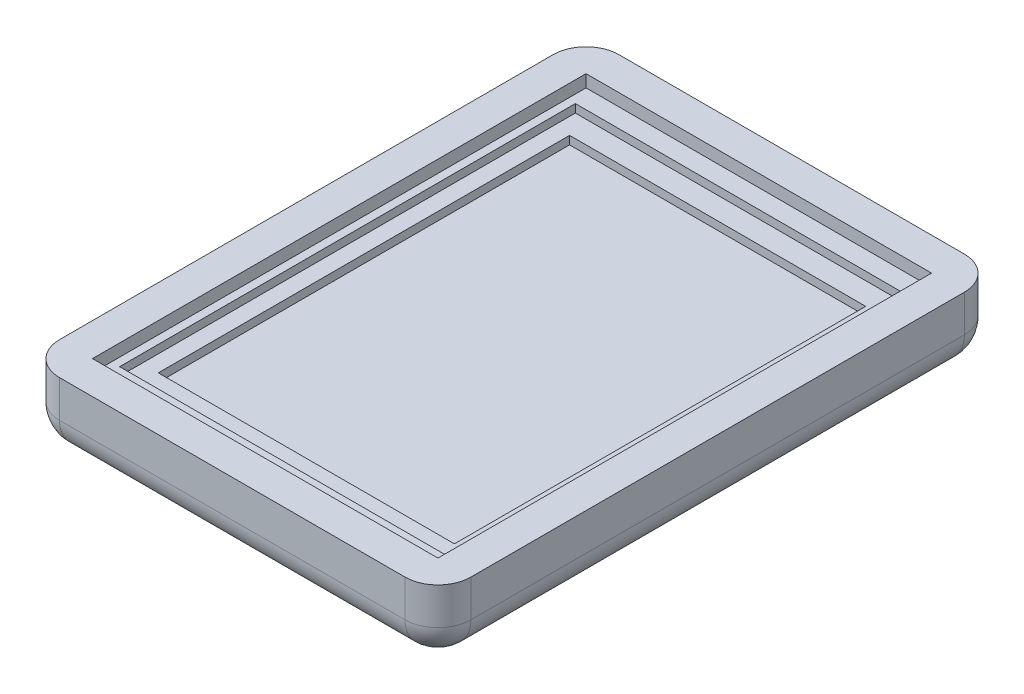
ISO-10303-21;
HEADER;
FILE_DESCRIPTION(('STEP AP214'),'2;1');
FILE_NAME('part.step','',(''),(''),'','','');
FILE_SCHEMA(('AUTOMOTIVE_DESIGN { 1 0 10303 214 1 1 1 1 }'));
ENDSEC;
DATA;
#1=APPLICATION_CONTEXT('core data for automotive mechanical design processes');
#2=APPLICATION_PROTOCOL_DEFINITION('international standard','automotive_design',2000,#1);
#3=PRODUCT_CONTEXT('',#1,'mechanical');
#4=PRODUCT('Part','Part','',(#3));
#5=PRODUCT_RELATED_PRODUCT_CATEGORY('part','',(#4));
#6=PRODUCT_DEFINITION_FORMATION('','',#4);
#7=PRODUCT_DEFINITION_CONTEXT('part definition',#1,'design');
#8=PRODUCT_DEFINITION('design','',#6,#7);
#9=PRODUCT_DEFINITION_SHAPE('','',#8);
#10=(LENGTH_UNIT() NAMED_UNIT(*) SI_UNIT(.MILLI.,.METRE.));
#11=(NAMED_UNIT(*) PLANE_ANGLE_UNIT() SI_UNIT($,.RADIAN.));
#12=(NAMED_UNIT(*) SI_UNIT($,.STERADIAN.) SOLID_ANGLE_UNIT());
#13=UNCERTAINTY_MEASURE_WITH_UNIT(LENGTH_MEASURE(1.E-05),#10,'distance_accuracy_value','');
#14=(GEOMETRIC_REPRESENTATION_CONTEXT(3) GLOBAL_UNCERTAINTY_ASSIGNED_CONTEXT((#13)) GLOBAL_UNIT_ASSIGNED_CONTEXT((#10,
#11,#12)) REPRESENTATION_CONTEXT('',''));
#15=CARTESIAN_POINT('',(0.,0.,0.));
#16=DIRECTION('',(0.,0.,1.));
#17=DIRECTION('',(1.,0.,0.));
#18=AXIS2_PLACEMENT_3D('',#15,#16,#17);
#19=CARTESIAN_POINT('',(0.,-1.905,0.));
#20=DIRECTION('',(0.,-1.,0.));
#21=DIRECTION('',(0.,0.,-1.));
#22=AXIS2_PLACEMENT_3D('',#19,#20,#21);
#23=PLANE('',#22);
#24=DIRECTION('',(0.,0.,-1.));
#25=VECTOR('',#24,1.);
#26=CARTESIAN_POINT('',(53.34,-1.905,-76.2));
#27=LINE('',#26,#25);
#28=CARTESIAN_POINT('',(53.34,-1.905,0.));
#29=VERTEX_POINT('',#28);
#30=CARTESIAN_POINT('',(53.34,-1.905,-76.2));
#31=VERTEX_POINT('',#30);
#32=EDGE_CURVE('E277',#29,#31,#27,.T.);
#33=ORIENTED_EDGE('',*,*,#32,.T.);
#34=DIRECTION('',(-1.,0.,0.));
#35=VECTOR('',#34,1.);
#36=CARTESIAN_POINT('',(53.34,-1.905,-76.2));
#37=LINE('',#36,#35);
#38=CARTESIAN_POINT('',(0.,-1.905,-76.2));
#39=VERTEX_POINT('',#38);
#40=EDGE_CURVE('E84',#31,#39,#37,.T.);
#41=ORIENTED_EDGE('',*,*,#40,.T.);
#42=DIRECTION('',(0.,0.,1.));
#43=VECTOR('',#42,1.);
#44=CARTESIAN_POINT('',(0.,-1.905,-76.2));
#45=LINE('',#44,#43);
#46=CARTESIAN_POINT('',(0.,-1.905,0.));
#47=VERTEX_POINT('',#46);
#48=EDGE_CURVE('E285',#39,#47,#45,.T.);
#49=ORIENTED_EDGE('',*,*,#48,.T.);
#50=DIRECTION('',(1.,0.,0.));
#51=VECTOR('',#50,1.);
#52=CARTESIAN_POINT('',(53.34,-1.905,0.));
#53=LINE('',#52,#51);
#54=EDGE_CURVE('E287',#47,#29,#53,.T.);
#55=ORIENTED_EDGE('',*,*,#54,.T.);
#56=EDGE_LOOP('',(#33,#41,#49,#55));
#57=FACE_BOUND('',#56,.T.);
#58=DIRECTION('',(0.,0.,-1.));
#59=VECTOR('',#58,1.);
#60=CARTESIAN_POINT('',(1.27,-1.905,0.));
#61=LINE('',#60,#59);
#62=CARTESIAN_POINT('',(1.27,-1.905,-2.92099999999999));
#63=VERTEX_POINT('',#62);
#64=CARTESIAN_POINT('',(1.27,-1.905,-73.279));
#65=VERTEX_POINT('',#64);
#66=EDGE_CURVE('E76',#63,#65,#61,.T.);
#67=ORIENTED_EDGE('',*,*,#66,.T.);
#68=DIRECTION('',(1.,0.,0.));
#69=VECTOR('',#68,1.);
#70=CARTESIAN_POINT('',(0.,-1.905,-73.279));
#71=LINE('',#70,#69);
#72=CARTESIAN_POINT('',(52.07,-1.905,-73.279));
#73=VERTEX_POINT('',#72);
#74=EDGE_CURVE('E249',#65,#73,#71,.T.);
#75=ORIENTED_EDGE('',*,*,#74,.T.);
#76=DIRECTION('',(0.,0.,-1.));
#77=VECTOR('',#76,1.);
#78=CARTESIAN_POINT('',(52.07,-1.905,0.));
#79=LINE('',#78,#77);
#80=CARTESIAN_POINT('',(52.07,-1.905,-2.92099999999999));
#81=VERTEX_POINT('',#80);
#82=EDGE_CURVE('E270',#81,#73,#79,.T.);
#83=ORIENTED_EDGE('',*,*,#82,.F.);
#84=DIRECTION('',(1.,0.,0.));
#85=VECTOR('',#84,1.);
#86=CARTESIAN_POINT('',(0.,-1.905,-2.92099999999999));
#87=LINE('',#86,#85);
#88=EDGE_CURVE('E267',#63,#81,#87,.T.);
#89=ORIENTED_EDGE('',*,*,#88,.F.);
#90=EDGE_LOOP('',(#67,#75,#83,#89));
#91=FACE_BOUND('',#90,.T.);
#92=ADVANCED_FACE('F59',(#57,#91),#23,.F.);
#93=CARTESIAN_POINT('',(0.,-5.715,0.));
#94=DIRECTION('',(0.,0.,1.));
#95=DIRECTION('',(1.,0.,0.));
#96=AXIS2_PLACEMENT_3D('',#93,#94,#95);
#97=PLANE('',#96);
#98=ORIENTED_EDGE('',*,*,#54,.F.);
#99=DIRECTION('',(0.,1.,0.));
#100=VECTOR('',#99,1.);
#101=CARTESIAN_POINT('',(0.,-5.715,0.));
#102=LINE('',#101,#100);
#103=CARTESIAN_POINT('',(0.,0.,0.));
#104=VERTEX_POINT('',#103);
#105=EDGE_CURVE('E314',#47,#104,#102,.T.);
#106=ORIENTED_EDGE('',*,*,#105,.T.);
#107=DIRECTION('',(1.,0.,0.));
#108=VECTOR('',#107,1.);
#109=CARTESIAN_POINT('',(0.,0.,0.));
#110=LINE('',#109,#108);
#111=CARTESIAN_POINT('',(53.34,0.,0.));
#112=VERTEX_POINT('',#111);
#113=EDGE_CURVE('E302',#104,#112,#110,.T.);
#114=ORIENTED_EDGE('',*,*,#113,.T.);
#115=DIRECTION('',(0.,1.,0.));
#116=VECTOR('',#115,1.);
#117=CARTESIAN_POINT('',(53.34,-5.715,0.));
#118=LINE('',#117,#116);
#119=EDGE_CURVE('E315',#29,#112,#118,.T.);
#120=ORIENTED_EDGE('',*,*,#119,.F.);
#121=EDGE_LOOP('',(#98,#106,#114,#120));
#122=FACE_BOUND('',#121,.T.);
#123=ADVANCED_FACE('F465',(#122),#97,.F.);
#124=CARTESIAN_POINT('',(53.34,-5.715,0.));
#125=DIRECTION('',(1.,0.,0.));
#126=DIRECTION('',(0.,0.,-1.));
#127=AXIS2_PLACEMENT_3D('',#124,#125,#126);
#128=PLANE('',#127);
#129=ORIENTED_EDGE('',*,*,#32,.F.);
#130=ORIENTED_EDGE('',*,*,#119,.T.);
#131=DIRECTION('',(0.,0.,-1.));
#132=VECTOR('',#131,1.);
#133=CARTESIAN_POINT('',(53.34,0.,0.));
#134=LINE('',#133,#132);
#135=CARTESIAN_POINT('',(53.34,0.,-76.2));
#136=VERTEX_POINT('',#135);
#137=EDGE_CURVE('E311',#112,#136,#134,.T.);
#138=ORIENTED_EDGE('',*,*,#137,.T.);
#139=DIRECTION('',(0.,1.,0.));
#140=VECTOR('',#139,1.);
#141=CARTESIAN_POINT('',(53.34,-5.715,-76.2));
#142=LINE('',#141,#140);
#143=EDGE_CURVE('E318',#31,#136,#142,.T.);
#144=ORIENTED_EDGE('',*,*,#143,.F.);
#145=EDGE_LOOP('',(#129,#130,#138,#144));
#146=FACE_BOUND('',#145,.T.);
#147=ADVANCED_FACE('F470',(#146),#128,.F.);
#148=CARTESIAN_POINT('',(0.,-5.715,-76.2));
#149=DIRECTION('',(0.,0.,1.));
#150=DIRECTION('',(1.,0.,0.));
#151=AXIS2_PLACEMENT_3D('',#148,#149,#150);
#152=PLANE('',#151);
#153=DIRECTION('',(0.,1.,0.));
#154=VECTOR('',#153,1.);
#155=CARTESIAN_POINT('',(0.,-5.715,-76.2));
#156=LINE('',#155,#154);
#157=CARTESIAN_POINT('',(0.,0.,-76.2));
#158=VERTEX_POINT('',#157);
#159=EDGE_CURVE('E320',#39,#158,#156,.T.);
#160=ORIENTED_EDGE('',*,*,#159,.F.);
#161=ORIENTED_EDGE('',*,*,#40,.F.);
#162=ORIENTED_EDGE('',*,*,#143,.T.);
#163=DIRECTION('',(1.,0.,0.));
#164=VECTOR('',#163,1.);
#165=CARTESIAN_POINT('',(0.,0.,-76.2));
#166=LINE('',#165,#164);
#167=EDGE_CURVE('E308',#158,#136,#166,.T.);
#168=ORIENTED_EDGE('',*,*,#167,.F.);
#169=EDGE_LOOP('',(#160,#161,#162,#168));
#170=FACE_BOUND('',#169,.T.);
#171=ADVANCED_FACE('F482',(#170),#152,.T.);
#172=CARTESIAN_POINT('',(0.,-5.715,0.));
#173=DIRECTION('',(1.,0.,0.));
#174=DIRECTION('',(0.,0.,-1.));
#175=AXIS2_PLACEMENT_3D('',#172,#173,#174);
#176=PLANE('',#175);
#177=ORIENTED_EDGE('',*,*,#105,.F.);
#178=ORIENTED_EDGE('',*,*,#48,.F.);
#179=ORIENTED_EDGE('',*,*,#159,.T.);
#180=DIRECTION('',(0.,0.,-1.));
#181=VECTOR('',#180,1.);
#182=CARTESIAN_POINT('',(0.,0.,0.));
#183=LINE('',#182,#181);
#184=EDGE_CURVE('E305',#104,#158,#183,.T.);
#185=ORIENTED_EDGE('',*,*,#184,.F.);
#186=EDGE_LOOP('',(#177,#178,#179,#185));
#187=FACE_BOUND('',#186,.T.);
#188=ADVANCED_FACE('F486',(#187),#176,.T.);
#189=CARTESIAN_POINT('',(0.,-5.715,5.08));
#190=DIRECTION('',(0.,0.,-1.));
#191=DIRECTION('',(-1.,0.,0.));
#192=AXIS2_PLACEMENT_3D('',#189,#190,#191);
#193=PLANE('',#192);
#194=DIRECTION('',(-1.,0.,0.));
#195=VECTOR('',#194,1.);
#196=CARTESIAN_POINT('',(0.,0.,5.08));
#197=LINE('',#196,#195);
#198=CARTESIAN_POINT('',(53.34,0.,5.07999999999999));
#199=VERTEX_POINT('',#198);
#200=CARTESIAN_POINT('',(0.,0.,5.08));
#201=VERTEX_POINT('',#200);
#202=EDGE_CURVE('E290',#199,#201,#197,.T.);
#203=ORIENTED_EDGE('',*,*,#202,.T.);
#204=DIRECTION('',(0.,1.,0.));
#205=VECTOR('',#204,1.);
#206=CARTESIAN_POINT('',(0.,-5.715,5.08));
#207=LINE('',#206,#205);
#208=CARTESIAN_POINT('',(0.,-5.715,5.08));
#209=VERTEX_POINT('',#208);
#210=EDGE_CURVE('E350',#201,#209,#207,.F.);
#211=ORIENTED_EDGE('',*,*,#210,.T.);
#212=DIRECTION('',(-1.,0.,0.));
#213=VECTOR('',#212,1.);
#214=CARTESIAN_POINT('',(0.,-5.715,5.08));
#215=LINE('',#214,#213);
#216=CARTESIAN_POINT('',(53.34,-5.715,5.07999999999999));
#217=VERTEX_POINT('',#216);
#218=EDGE_CURVE('E348',#209,#217,#215,.F.);
#219=ORIENTED_EDGE('',*,*,#218,.T.);
#220=DIRECTION('',(0.,1.,0.));
#221=VECTOR('',#220,1.);
#222=CARTESIAN_POINT('',(53.34,0.,5.07999999999999));
#223=LINE('',#222,#221);
#224=EDGE_CURVE('E346',#217,#199,#223,.T.);
#225=ORIENTED_EDGE('',*,*,#224,.T.);
#226=EDGE_LOOP('',(#203,#211,#219,#225));
#227=FACE_BOUND('',#226,.T.);
#228=ADVANCED_FACE('F456',(#227),#193,.F.);
#229=CARTESIAN_POINT('',(-5.08,-5.715,0.));
#230=DIRECTION('',(1.,0.,0.));
#231=DIRECTION('',(0.,0.,-1.));
#232=AXIS2_PLACEMENT_3D('',#229,#230,#231);
#233=PLANE('',#232);
#234=DIRECTION('',(0.,0.,-1.));
#235=VECTOR('',#234,1.);
#236=CARTESIAN_POINT('',(-5.08,-5.715,0.));
#237=LINE('',#236,#235);
#238=CARTESIAN_POINT('',(-5.08,-5.715,-76.2));
#239=VERTEX_POINT('',#238);
#240=CARTESIAN_POINT('',(-5.08,-5.715,0.));
#241=VERTEX_POINT('',#240);
#242=EDGE_CURVE('E333',#239,#241,#237,.F.);
#243=ORIENTED_EDGE('',*,*,#242,.T.);
#244=DIRECTION('',(0.,1.,0.));
#245=VECTOR('',#244,1.);
#246=CARTESIAN_POINT('',(-5.08,-5.715,0.));
#247=LINE('',#246,#245);
#248=CARTESIAN_POINT('',(-5.08,0.,0.));
#249=VERTEX_POINT('',#248);
#250=EDGE_CURVE('E336',#241,#249,#247,.T.);
#251=ORIENTED_EDGE('',*,*,#250,.T.);
#252=DIRECTION('',(0.,0.,-1.));
#253=VECTOR('',#252,1.);
#254=CARTESIAN_POINT('',(-5.08,0.,0.));
#255=LINE('',#254,#253);
#256=CARTESIAN_POINT('',(-5.08,0.,-76.2));
#257=VERTEX_POINT('',#256);
#258=EDGE_CURVE('E299',#249,#257,#255,.T.);
#259=ORIENTED_EDGE('',*,*,#258,.T.);
#260=DIRECTION('',(0.,1.,0.));
#261=VECTOR('',#260,1.);
#262=CARTESIAN_POINT('',(-5.08,-5.715,-76.2));
#263=LINE('',#262,#261);
#264=EDGE_CURVE('E331',#257,#239,#263,.F.);
#265=ORIENTED_EDGE('',*,*,#264,.T.);
#266=EDGE_LOOP('',(#243,#251,#259,#265));
#267=FACE_BOUND('',#266,.T.);
#268=ADVANCED_FACE('F448',(#267),#233,.F.);
#269=CARTESIAN_POINT('',(0.,-5.715,-81.28));
#270=DIRECTION('',(0.,0.,1.));
#271=DIRECTION('',(1.,0.,0.));
#272=AXIS2_PLACEMENT_3D('',#269,#270,#271);
#273=PLANE('',#272);
#274=DIRECTION('',(1.,0.,0.));
#275=VECTOR('',#274,1.);
#276=CARTESIAN_POINT('',(0.,0.,-81.28));
#277=LINE('',#276,#275);
#278=CARTESIAN_POINT('',(0.,0.,-81.28));
#279=VERTEX_POINT('',#278);
#280=CARTESIAN_POINT('',(53.34,0.,-81.28));
#281=VERTEX_POINT('',#280);
#282=EDGE_CURVE('E296',#279,#281,#277,.T.);
#283=ORIENTED_EDGE('',*,*,#282,.T.);
#284=DIRECTION('',(0.,1.,0.));
#285=VECTOR('',#284,1.);
#286=CARTESIAN_POINT('',(53.34,-10.795,-81.28));
#287=LINE('',#286,#285);
#288=CARTESIAN_POINT('',(53.34,-5.715,-81.28));
#289=VERTEX_POINT('',#288);
#290=EDGE_CURVE('E13',#281,#289,#287,.F.);
#291=ORIENTED_EDGE('',*,*,#290,.T.);
#292=DIRECTION('',(1.,0.,0.));
#293=VECTOR('',#292,1.);
#294=CARTESIAN_POINT('',(0.,-5.715,-81.28));
#295=LINE('',#294,#293);
#296=CARTESIAN_POINT('',(0.,-5.715,-81.28));
#297=VERTEX_POINT('',#296);
#298=EDGE_CURVE('E68',#289,#297,#295,.F.);
#299=ORIENTED_EDGE('',*,*,#298,.T.);
#300=DIRECTION('',(0.,1.,0.));
#301=VECTOR('',#300,1.);
#302=CARTESIAN_POINT('',(0.,-5.715,-81.28));
#303=LINE('',#302,#301);
#304=EDGE_CURVE('E358',#297,#279,#303,.T.);
#305=ORIENTED_EDGE('',*,*,#304,.T.);
#306=EDGE_LOOP('',(#283,#291,#299,#305));
#307=FACE_BOUND('',#306,.T.);
#308=ADVANCED_FACE('F431',(#307),#273,.F.);
#309=CARTESIAN_POINT('',(58.42,-5.715,0.));
#310=DIRECTION('',(1.,0.,0.));
#311=DIRECTION('',(0.,0.,-1.));
#312=AXIS2_PLACEMENT_3D('',#309,#310,#311);
#313=PLANE('',#312);
#314=DIRECTION('',(0.,0.,-1.));
#315=VECTOR('',#314,1.);
#316=CARTESIAN_POINT('',(58.42,0.,0.));
#317=LINE('',#316,#315);
#318=CARTESIAN_POINT('',(58.42,0.,0.));
#319=VERTEX_POINT('',#318);
#320=CARTESIAN_POINT('',(58.42,0.,-76.2));
#321=VERTEX_POINT('',#320);
#322=EDGE_CURVE('E293',#319,#321,#317,.T.);
#323=ORIENTED_EDGE('',*,*,#322,.F.);
#324=DIRECTION('',(0.,1.,0.));
#325=VECTOR('',#324,1.);
#326=CARTESIAN_POINT('',(58.42,-10.795,0.));
#327=LINE('',#326,#325);
#328=CARTESIAN_POINT('',(58.42,-5.715,0.));
#329=VERTEX_POINT('',#328);
#330=EDGE_CURVE('E356',#319,#329,#327,.F.);
#331=ORIENTED_EDGE('',*,*,#330,.T.);
#332=DIRECTION('',(0.,0.,1.));
#333=VECTOR('',#332,1.);
#334=CARTESIAN_POINT('',(58.42,-5.715,-81.28));
#335=LINE('',#334,#333);
#336=CARTESIAN_POINT('',(58.42,-5.715,-76.2));
#337=VERTEX_POINT('',#336);
#338=EDGE_CURVE('E354',#329,#337,#335,.F.);
#339=ORIENTED_EDGE('',*,*,#338,.T.);
#340=DIRECTION('',(0.,1.,0.));
#341=VECTOR('',#340,1.);
#342=CARTESIAN_POINT('',(58.42,0.,-76.2));
#343=LINE('',#342,#341);
#344=EDGE_CURVE('E352',#337,#321,#343,.T.);
#345=ORIENTED_EDGE('',*,*,#344,.T.);
#346=EDGE_LOOP('',(#323,#331,#339,#345));
#347=FACE_BOUND('',#346,.T.);
#348=ADVANCED_FACE('F417',(#347),#313,.T.);
#349=CARTESIAN_POINT('',(0.,0.,0.));
#350=DIRECTION('',(0.,1.,0.));
#351=DIRECTION('',(0.,0.,1.));
#352=AXIS2_PLACEMENT_3D('',#349,#350,#351);
#353=PLANE('',#352);
#354=ORIENTED_EDGE('',*,*,#258,.F.);
#355=CARTESIAN_POINT('',(0.,0.,0.));
#356=DIRECTION('',(0.,1.,0.));
#357=DIRECTION('',(0.,0.,1.));
#358=AXIS2_PLACEMENT_3D('',#355,#356,#357);
#359=CIRCLE('',#358,5.08);
#360=EDGE_CURVE('E344',#249,#201,#359,.T.);
#361=ORIENTED_EDGE('',*,*,#360,.T.);
#362=ORIENTED_EDGE('',*,*,#202,.F.);
#363=CARTESIAN_POINT('',(53.34,0.,0.));
#364=DIRECTION('',(0.,1.,0.));
#365=DIRECTION('',(0.,0.,1.));
#366=AXIS2_PLACEMENT_3D('',#363,#364,#365);
#367=CIRCLE('',#366,5.08);
#368=EDGE_CURVE('E342',#199,#319,#367,.T.);
#369=ORIENTED_EDGE('',*,*,#368,.T.);
#370=ORIENTED_EDGE('',*,*,#322,.T.);
#371=CARTESIAN_POINT('',(53.34,0.,-76.2));
#372=DIRECTION('',(0.,1.,0.));
#373=DIRECTION('',(0.,0.,1.));
#374=AXIS2_PLACEMENT_3D('',#371,#372,#373);
#375=CIRCLE('',#374,5.08);
#376=EDGE_CURVE('E340',#321,#281,#375,.T.);
#377=ORIENTED_EDGE('',*,*,#376,.T.);
#378=ORIENTED_EDGE('',*,*,#282,.F.);
#379=CARTESIAN_POINT('',(0.,0.,-76.2));
#380=DIRECTION('',(0.,1.,0.));
#381=DIRECTION('',(0.,0.,1.));
#382=AXIS2_PLACEMENT_3D('',#379,#380,#381);
#383=CIRCLE('',#382,5.08);
#384=EDGE_CURVE('E338',#279,#257,#383,.T.);
#385=ORIENTED_EDGE('',*,*,#384,.T.);
#386=EDGE_LOOP('',(#354,#361,#362,#369,#370,#377,#378,#385));
#387=FACE_BOUND('',#386,.T.);
#388=ORIENTED_EDGE('',*,*,#113,.F.);
#389=ORIENTED_EDGE('',*,*,#184,.T.);
#390=ORIENTED_EDGE('',*,*,#167,.T.);
#391=ORIENTED_EDGE('',*,*,#137,.F.);
#392=EDGE_LOOP('',(#388,#389,#390,#391));
#393=FACE_BOUND('',#392,.T.);
#394=ADVANCED_FACE('F427',(#387,#393),#353,.T.);
#395=CARTESIAN_POINT('',(0.,-10.795,0.));
#396=DIRECTION('',(0.,1.,0.));
#397=DIRECTION('',(0.,0.,1.));
#398=AXIS2_PLACEMENT_3D('',#395,#396,#397);
#399=PLANE('',#398);
#400=DIRECTION('',(-1.,0.,0.));
#401=VECTOR('',#400,1.);
#402=CARTESIAN_POINT('',(0.,-10.795,0.));
#403=LINE('',#402,#401);
#404=CARTESIAN_POINT('',(53.34,-10.795,0.));
#405=VERTEX_POINT('',#404);
#406=CARTESIAN_POINT('',(0.,-10.795,0.));
#407=VERTEX_POINT('',#406);
#408=EDGE_CURVE('E326',#405,#407,#403,.T.);
#409=ORIENTED_EDGE('',*,*,#408,.T.);
#410=DIRECTION('',(0.,0.,-1.));
#411=VECTOR('',#410,1.);
#412=CARTESIAN_POINT('',(0.,-10.795,0.));
#413=LINE('',#412,#411);
#414=CARTESIAN_POINT('',(0.,-10.795,-76.2));
#415=VERTEX_POINT('',#414);
#416=EDGE_CURVE('E328',#407,#415,#413,.T.);
#417=ORIENTED_EDGE('',*,*,#416,.T.);
#418=DIRECTION('',(1.,0.,0.));
#419=VECTOR('',#418,1.);
#420=CARTESIAN_POINT('',(0.,-10.795,-76.2));
#421=LINE('',#420,#419);
#422=CARTESIAN_POINT('',(53.34,-10.795,-76.2));
#423=VERTEX_POINT('',#422);
#424=EDGE_CURVE('E317',#415,#423,#421,.T.);
#425=ORIENTED_EDGE('',*,*,#424,.T.);
#426=DIRECTION('',(0.,0.,1.));
#427=VECTOR('',#426,1.);
#428=CARTESIAN_POINT('',(53.34,-10.795,5.08));
#429=LINE('',#428,#427);
#430=EDGE_CURVE('E324',#423,#405,#429,.T.);
#431=ORIENTED_EDGE('',*,*,#430,.T.);
#432=EDGE_LOOP('',(#409,#417,#425,#431));
#433=FACE_BOUND('',#432,.T.);
#434=ADVANCED_FACE('F406',(#433),#399,.F.);
#435=CARTESIAN_POINT('',(53.34,-5.715,0.));
#436=DIRECTION('',(0.,-1.,0.));
#437=DIRECTION('',(0.,0.,-1.));
#438=AXIS2_PLACEMENT_3D('',#435,#436,#437);
#439=CYLINDRICAL_SURFACE('',#438,5.08);
#440=ORIENTED_EDGE('',*,*,#368,.F.);
#441=ORIENTED_EDGE('',*,*,#224,.F.);
#442=CARTESIAN_POINT('',(53.34,-5.715,0.));
#443=DIRECTION('',(0.,-1.,0.));
#444=DIRECTION('',(0.,0.,-1.));
#445=AXIS2_PLACEMENT_3D('',#442,#443,#444);
#446=CIRCLE('',#445,5.08);
#447=EDGE_CURVE('E63',#329,#217,#446,.T.);
#448=ORIENTED_EDGE('',*,*,#447,.F.);
#449=ORIENTED_EDGE('',*,*,#330,.F.);
#450=EDGE_LOOP('',(#440,#441,#448,#449));
#451=FACE_BOUND('',#450,.T.);
#452=ADVANCED_FACE('F61',(#451),#439,.T.);
#453=CARTESIAN_POINT('',(53.34,-5.715,0.));
#454=DIRECTION('',(0.,0.,-1.));
#455=DIRECTION('',(-1.,0.,0.));
#456=AXIS2_PLACEMENT_3D('',#453,#454,#455);
#457=CYLINDRICAL_SURFACE('',#456,5.08);
#458=CARTESIAN_POINT('',(53.34,-5.715,-76.2));
#459=DIRECTION('',(0.,0.,-1.));
#460=DIRECTION('',(-1.,0.,0.));
#461=AXIS2_PLACEMENT_3D('',#458,#459,#460);
#462=CIRCLE('',#461,5.08);
#463=EDGE_CURVE('E385',#337,#423,#462,.T.);
#464=ORIENTED_EDGE('',*,*,#463,.F.);
#465=ORIENTED_EDGE('',*,*,#338,.F.);
#466=CARTESIAN_POINT('',(53.34,-5.715,0.));
#467=DIRECTION('',(0.,0.,1.));
#468=DIRECTION('',(1.,0.,0.));
#469=AXIS2_PLACEMENT_3D('',#466,#467,#468);
#470=CIRCLE('',#469,5.08);
#471=EDGE_CURVE('E387',#405,#329,#470,.T.);
#472=ORIENTED_EDGE('',*,*,#471,.F.);
#473=ORIENTED_EDGE('',*,*,#430,.F.);
#474=EDGE_LOOP('',(#464,#465,#472,#473));
#475=FACE_BOUND('',#474,.T.);
#476=ADVANCED_FACE('F413',(#475),#457,.T.);
#477=CARTESIAN_POINT('',(53.34,-5.715,-76.2));
#478=DIRECTION('',(0.,-1.,0.));
#479=DIRECTION('',(0.,0.,-1.));
#480=AXIS2_PLACEMENT_3D('',#477,#478,#479);
#481=CYLINDRICAL_SURFACE('',#480,5.08);
#482=ORIENTED_EDGE('',*,*,#376,.F.);
#483=ORIENTED_EDGE('',*,*,#344,.F.);
#484=CARTESIAN_POINT('',(53.34,-5.715,-76.2));
#485=DIRECTION('',(0.,-1.,0.));
#486=DIRECTION('',(0.,0.,-1.));
#487=AXIS2_PLACEMENT_3D('',#484,#485,#486);
#488=CIRCLE('',#487,5.08);
#489=EDGE_CURVE('E382',#289,#337,#488,.T.);
#490=ORIENTED_EDGE('',*,*,#489,.F.);
#491=ORIENTED_EDGE('',*,*,#290,.F.);
#492=EDGE_LOOP('',(#482,#483,#490,#491));
#493=FACE_BOUND('',#492,.T.);
#494=ADVANCED_FACE('F421',(#493),#481,.T.);
#495=CARTESIAN_POINT('',(53.34,-5.715,0.));
#496=DIRECTION('',(0.,0.,1.));
#497=DIRECTION('',(1.,0.,0.));
#498=AXIS2_PLACEMENT_3D('',#495,#496,#497);
#499=SPHERICAL_SURFACE('',#498,5.08);
#500=ORIENTED_EDGE('',*,*,#471,.T.);
#501=ORIENTED_EDGE('',*,*,#447,.T.);
#502=CARTESIAN_POINT('',(53.34,-5.715,0.));
#503=DIRECTION('',(1.,0.,0.));
#504=DIRECTION('',(0.,0.,-1.));
#505=AXIS2_PLACEMENT_3D('',#502,#503,#504);
#506=CIRCLE('',#505,5.08);
#507=EDGE_CURVE('E379',#405,#217,#506,.F.);
#508=ORIENTED_EDGE('',*,*,#507,.F.);
#509=EDGE_LOOP('',(#500,#501,#508));
#510=FACE_BOUND('',#509,.T.);
#511=ADVANCED_FACE('F394',(#510),#499,.T.);
#512=CARTESIAN_POINT('',(53.34,-5.715,-76.2));
#513=DIRECTION('',(0.,0.,1.));
#514=DIRECTION('',(1.,0.,0.));
#515=AXIS2_PLACEMENT_3D('',#512,#513,#514);
#516=SPHERICAL_SURFACE('',#515,5.08);
#517=ORIENTED_EDGE('',*,*,#489,.T.);
#518=ORIENTED_EDGE('',*,*,#463,.T.);
#519=CARTESIAN_POINT('',(53.34,-5.715,-76.2));
#520=DIRECTION('',(1.,0.,0.));
#521=DIRECTION('',(0.,0.,-1.));
#522=AXIS2_PLACEMENT_3D('',#519,#520,#521);
#523=CIRCLE('',#522,5.08);
#524=EDGE_CURVE('E376',#289,#423,#523,.F.);
#525=ORIENTED_EDGE('',*,*,#524,.F.);
#526=EDGE_LOOP('',(#517,#518,#525));
#527=FACE_BOUND('',#526,.T.);
#528=ADVANCED_FACE('F515',(#527),#516,.T.);
#529=CARTESIAN_POINT('',(0.,-5.715,0.));
#530=DIRECTION('',(0.,1.,0.));
#531=DIRECTION('',(0.,0.,1.));
#532=AXIS2_PLACEMENT_3D('',#529,#530,#531);
#533=CYLINDRICAL_SURFACE('',#532,5.08);
#534=ORIENTED_EDGE('',*,*,#360,.F.);
#535=ORIENTED_EDGE('',*,*,#250,.F.);
#536=CARTESIAN_POINT('',(0.,-5.715,0.));
#537=DIRECTION('',(0.,-1.,0.));
#538=DIRECTION('',(0.,0.,-1.));
#539=AXIS2_PLACEMENT_3D('',#536,#537,#538);
#540=CIRCLE('',#539,5.08);
#541=EDGE_CURVE('E373',#209,#241,#540,.T.);
#542=ORIENTED_EDGE('',*,*,#541,.F.);
#543=ORIENTED_EDGE('',*,*,#210,.F.);
#544=EDGE_LOOP('',(#534,#535,#542,#543));
#545=FACE_BOUND('',#544,.T.);
#546=ADVANCED_FACE('F454',(#545),#533,.T.);
#547=CARTESIAN_POINT('',(0.,-5.715,0.));
#548=DIRECTION('',(-1.,0.,0.));
#549=DIRECTION('',(0.,0.,1.));
#550=AXIS2_PLACEMENT_3D('',#547,#548,#549);
#551=CYLINDRICAL_SURFACE('',#550,5.08);
#552=ORIENTED_EDGE('',*,*,#507,.T.);
#553=ORIENTED_EDGE('',*,*,#218,.F.);
#554=CARTESIAN_POINT('',(0.,-5.715,0.));
#555=DIRECTION('',(-1.,0.,0.));
#556=DIRECTION('',(0.,0.,1.));
#557=AXIS2_PLACEMENT_3D('',#554,#555,#556);
#558=CIRCLE('',#557,5.08);
#559=EDGE_CURVE('E370',#407,#209,#558,.T.);
#560=ORIENTED_EDGE('',*,*,#559,.F.);
#561=ORIENTED_EDGE('',*,*,#408,.F.);
#562=EDGE_LOOP('',(#552,#553,#560,#561));
#563=FACE_BOUND('',#562,.T.);
#564=ADVANCED_FACE('F401',(#563),#551,.T.);
#565=CARTESIAN_POINT('',(0.,-5.715,-76.2));
#566=DIRECTION('',(1.,0.,0.));
#567=DIRECTION('',(0.,0.,-1.));
#568=AXIS2_PLACEMENT_3D('',#565,#566,#567);
#569=CYLINDRICAL_SURFACE('',#568,5.08);
#570=ORIENTED_EDGE('',*,*,#524,.T.);
#571=ORIENTED_EDGE('',*,*,#424,.F.);
#572=CARTESIAN_POINT('',(0.,-5.715,-76.2));
#573=DIRECTION('',(-1.,0.,0.));
#574=DIRECTION('',(0.,0.,1.));
#575=AXIS2_PLACEMENT_3D('',#572,#573,#574);
#576=CIRCLE('',#575,5.08);
#577=EDGE_CURVE('E367',#297,#415,#576,.T.);
#578=ORIENTED_EDGE('',*,*,#577,.F.);
#579=ORIENTED_EDGE('',*,*,#298,.F.);
#580=EDGE_LOOP('',(#570,#571,#578,#579));
#581=FACE_BOUND('',#580,.T.);
#582=ADVANCED_FACE('F441',(#581),#569,.T.);
#583=CARTESIAN_POINT('',(0.,-5.715,-76.2));
#584=DIRECTION('',(0.,1.,0.));
#585=DIRECTION('',(0.,0.,1.));
#586=AXIS2_PLACEMENT_3D('',#583,#584,#585);
#587=CYLINDRICAL_SURFACE('',#586,5.08);
#588=ORIENTED_EDGE('',*,*,#384,.F.);
#589=ORIENTED_EDGE('',*,*,#304,.F.);
#590=CARTESIAN_POINT('',(0.,-5.715,-76.2));
#591=DIRECTION('',(0.,-1.,0.));
#592=DIRECTION('',(0.,0.,-1.));
#593=AXIS2_PLACEMENT_3D('',#590,#591,#592);
#594=CIRCLE('',#593,5.08);
#595=EDGE_CURVE('E364',#239,#297,#594,.T.);
#596=ORIENTED_EDGE('',*,*,#595,.F.);
#597=ORIENTED_EDGE('',*,*,#264,.F.);
#598=EDGE_LOOP('',(#588,#589,#596,#597));
#599=FACE_BOUND('',#598,.T.);
#600=ADVANCED_FACE('F437',(#599),#587,.T.);
#601=CARTESIAN_POINT('',(0.,-5.715,0.));
#602=DIRECTION('',(0.,0.,1.));
#603=DIRECTION('',(1.,0.,0.));
#604=AXIS2_PLACEMENT_3D('',#601,#602,#603);
#605=SPHERICAL_SURFACE('',#604,5.08);
#606=ORIENTED_EDGE('',*,*,#559,.T.);
#607=ORIENTED_EDGE('',*,*,#541,.T.);
#608=CARTESIAN_POINT('',(0.,-5.715,0.));
#609=DIRECTION('',(0.,0.,1.));
#610=DIRECTION('',(1.,0.,0.));
#611=AXIS2_PLACEMENT_3D('',#608,#609,#610);
#612=CIRCLE('',#611,5.08);
#613=EDGE_CURVE('E362',#407,#241,#612,.F.);
#614=ORIENTED_EDGE('',*,*,#613,.F.);
#615=EDGE_LOOP('',(#606,#607,#614));
#616=FACE_BOUND('',#615,.T.);
#617=ADVANCED_FACE('F503',(#616),#605,.T.);
#618=CARTESIAN_POINT('',(0.,-5.715,-76.2));
#619=DIRECTION('',(0.,0.,1.));
#620=DIRECTION('',(1.,0.,0.));
#621=AXIS2_PLACEMENT_3D('',#618,#619,#620);
#622=SPHERICAL_SURFACE('',#621,5.08);
#623=ORIENTED_EDGE('',*,*,#595,.T.);
#624=ORIENTED_EDGE('',*,*,#577,.T.);
#625=CARTESIAN_POINT('',(0.,-5.715,-76.2));
#626=DIRECTION('',(0.,0.,-1.));
#627=DIRECTION('',(-1.,0.,0.));
#628=AXIS2_PLACEMENT_3D('',#625,#626,#627);
#629=CIRCLE('',#628,5.08);
#630=EDGE_CURVE('E289',#239,#415,#629,.F.);
#631=ORIENTED_EDGE('',*,*,#630,.F.);
#632=EDGE_LOOP('',(#623,#624,#631));
#633=FACE_BOUND('',#632,.T.);
#634=ADVANCED_FACE('F444',(#633),#622,.T.);
#635=CARTESIAN_POINT('',(0.,-5.715,0.));
#636=DIRECTION('',(0.,0.,-1.));
#637=DIRECTION('',(-1.,0.,0.));
#638=AXIS2_PLACEMENT_3D('',#635,#636,#637);
#639=CYLINDRICAL_SURFACE('',#638,5.08);
#640=ORIENTED_EDGE('',*,*,#613,.T.);
#641=ORIENTED_EDGE('',*,*,#242,.F.);
#642=ORIENTED_EDGE('',*,*,#630,.T.);
#643=ORIENTED_EDGE('',*,*,#416,.F.);
#644=EDGE_LOOP('',(#640,#641,#642,#643));
#645=FACE_BOUND('',#644,.T.);
#646=ADVANCED_FACE('F446',(#645),#639,.T.);
#647=CARTESIAN_POINT('',(1.27,-3.175,0.));
#648=DIRECTION('',(1.,0.,0.));
#649=DIRECTION('',(0.,0.,-1.));
#650=AXIS2_PLACEMENT_3D('',#647,#648,#649);
#651=PLANE('',#650);
#652=ORIENTED_EDGE('',*,*,#66,.F.);
#653=DIRECTION('',(0.,1.,0.));
#654=VECTOR('',#653,1.);
#655=CARTESIAN_POINT('',(1.27,-3.175,-2.92099999999999));
#656=LINE('',#655,#654);
#657=CARTESIAN_POINT('',(1.27,-3.175,-2.92099999999999));
#658=VERTEX_POINT('',#657);
#659=EDGE_CURVE('E265',#658,#63,#656,.T.);
#660=ORIENTED_EDGE('',*,*,#659,.F.);
#661=DIRECTION('',(0.,0.,-1.));
#662=VECTOR('',#661,1.);
#663=CARTESIAN_POINT('',(1.27,-3.175,0.));
#664=LINE('',#663,#662);
#665=CARTESIAN_POINT('',(1.27,-3.175,-73.279));
#666=VERTEX_POINT('',#665);
#667=EDGE_CURVE('E245',#658,#666,#664,.T.);
#668=ORIENTED_EDGE('',*,*,#667,.T.);
#669=DIRECTION('',(0.,1.,0.));
#670=VECTOR('',#669,1.);
#671=CARTESIAN_POINT('',(1.27,-3.175,-73.279));
#672=LINE('',#671,#670);
#673=EDGE_CURVE('E275',#666,#65,#672,.T.);
#674=ORIENTED_EDGE('',*,*,#673,.T.);
#675=EDGE_LOOP('',(#652,#660,#668,#674));
#676=FACE_BOUND('',#675,.T.);
#677=ADVANCED_FACE('F475',(#676),#651,.T.);
#678=CARTESIAN_POINT('',(0.,-3.175,-73.279));
#679=DIRECTION('',(0.,0.,1.));
#680=DIRECTION('',(1.,0.,0.));
#681=AXIS2_PLACEMENT_3D('',#678,#679,#680);
#682=PLANE('',#681);
#683=ORIENTED_EDGE('',*,*,#74,.F.);
#684=ORIENTED_EDGE('',*,*,#673,.F.);
#685=DIRECTION('',(1.,0.,0.));
#686=VECTOR('',#685,1.);
#687=CARTESIAN_POINT('',(0.,-3.175,-73.279));
#688=LINE('',#687,#686);
#689=CARTESIAN_POINT('',(52.07,-3.175,-73.279));
#690=VERTEX_POINT('',#689);
#691=EDGE_CURVE('E255',#666,#690,#688,.T.);
#692=ORIENTED_EDGE('',*,*,#691,.T.);
#693=DIRECTION('',(0.,1.,0.));
#694=VECTOR('',#693,1.);
#695=CARTESIAN_POINT('',(52.07,-3.175,-73.279));
#696=LINE('',#695,#694);
#697=EDGE_CURVE('E278',#690,#73,#696,.T.);
#698=ORIENTED_EDGE('',*,*,#697,.T.);
#699=EDGE_LOOP('',(#683,#684,#692,#698));
#700=FACE_BOUND('',#699,.T.);
#701=ADVANCED_FACE('F569',(#700),#682,.T.);
#702=CARTESIAN_POINT('',(52.07,-3.175,0.));
#703=DIRECTION('',(1.,0.,0.));
#704=DIRECTION('',(0.,0.,-1.));
#705=AXIS2_PLACEMENT_3D('',#702,#703,#704);
#706=PLANE('',#705);
#707=ORIENTED_EDGE('',*,*,#82,.T.);
#708=ORIENTED_EDGE('',*,*,#697,.F.);
#709=DIRECTION('',(0.,0.,-1.));
#710=VECTOR('',#709,1.);
#711=CARTESIAN_POINT('',(52.07,-3.175,0.));
#712=LINE('',#711,#710);
#713=CARTESIAN_POINT('',(52.07,-3.175,-2.92099999999999));
#714=VERTEX_POINT('',#713);
#715=EDGE_CURVE('E252',#714,#690,#712,.T.);
#716=ORIENTED_EDGE('',*,*,#715,.F.);
#717=DIRECTION('',(0.,1.,0.));
#718=VECTOR('',#717,1.);
#719=CARTESIAN_POINT('',(52.07,-3.175,-2.92099999999999));
#720=LINE('',#719,#718);
#721=EDGE_CURVE('E280',#714,#81,#720,.T.);
#722=ORIENTED_EDGE('',*,*,#721,.T.);
#723=EDGE_LOOP('',(#707,#708,#716,#722));
#724=FACE_BOUND('',#723,.T.);
#725=ADVANCED_FACE('F575',(#724),#706,.F.);
#726=CARTESIAN_POINT('',(0.,-3.175,-2.92099999999999));
#727=DIRECTION('',(0.,0.,1.));
#728=DIRECTION('',(1.,0.,0.));
#729=AXIS2_PLACEMENT_3D('',#726,#727,#728);
#730=PLANE('',#729);
#731=ORIENTED_EDGE('',*,*,#88,.T.);
#732=ORIENTED_EDGE('',*,*,#721,.F.);
#733=DIRECTION('',(1.,0.,0.));
#734=VECTOR('',#733,1.);
#735=CARTESIAN_POINT('',(0.,-3.175,-2.92099999999999));
#736=LINE('',#735,#734);
#737=EDGE_CURVE('E248',#658,#714,#736,.T.);
#738=ORIENTED_EDGE('',*,*,#737,.F.);
#739=ORIENTED_EDGE('',*,*,#659,.T.);
#740=EDGE_LOOP('',(#731,#732,#738,#739));
#741=FACE_BOUND('',#740,.T.);
#742=ADVANCED_FACE('F583',(#741),#730,.F.);
#743=CARTESIAN_POINT('',(0.,-3.175,0.));
#744=DIRECTION('',(0.,1.,0.));
#745=DIRECTION('',(0.,0.,1.));
#746=AXIS2_PLACEMENT_3D('',#743,#744,#745);
#747=PLANE('',#746);
#748=ORIENTED_EDGE('',*,*,#667,.F.);
#749=ORIENTED_EDGE('',*,*,#737,.T.);
#750=ORIENTED_EDGE('',*,*,#715,.T.);
#751=ORIENTED_EDGE('',*,*,#691,.F.);
#752=EDGE_LOOP('',(#748,#749,#750,#751));
#753=FACE_BOUND('',#752,.T.);
#754=DIRECTION('',(1.,0.,0.));
#755=VECTOR('',#754,1.);
#756=CARTESIAN_POINT('',(0.,-3.175,-6.34999999999999));
#757=LINE('',#756,#755);
#758=CARTESIAN_POINT('',(3.81000000000001,-3.175,-6.34999999999999));
#759=VERTEX_POINT('',#758);
#760=CARTESIAN_POINT('',(49.53,-3.175,-6.34999999999999));
#761=VERTEX_POINT('',#760);
#762=EDGE_CURVE('E257',#759,#761,#757,.T.);
#763=ORIENTED_EDGE('',*,*,#762,.F.);
#764=DIRECTION('',(0.,0.,-1.));
#765=VECTOR('',#764,1.);
#766=CARTESIAN_POINT('',(3.81000000000001,-3.175,0.));
#767=LINE('',#766,#765);
#768=CARTESIAN_POINT('',(3.81000000000001,-3.175,-69.85));
#769=VERTEX_POINT('',#768);
#770=EDGE_CURVE('E259',#759,#769,#767,.T.);
#771=ORIENTED_EDGE('',*,*,#770,.T.);
#772=DIRECTION('',(1.,0.,0.));
#773=VECTOR('',#772,1.);
#774=CARTESIAN_POINT('',(0.,-3.175,-69.85));
#775=LINE('',#774,#773);
#776=CARTESIAN_POINT('',(49.53,-3.175,-69.85));
#777=VERTEX_POINT('',#776);
#778=EDGE_CURVE('E262',#769,#777,#775,.T.);
#779=ORIENTED_EDGE('',*,*,#778,.T.);
#780=DIRECTION('',(0.,0.,-1.));
#781=VECTOR('',#780,1.);
#782=CARTESIAN_POINT('',(49.53,-3.175,0.));
#783=LINE('',#782,#781);
#784=EDGE_CURVE('E218',#761,#777,#783,.T.);
#785=ORIENTED_EDGE('',*,*,#784,.F.);
#786=EDGE_LOOP('',(#763,#771,#779,#785));
#787=FACE_BOUND('',#786,.T.);
#788=ADVANCED_FACE('F591',(#753,#787),#747,.T.);
#789=CARTESIAN_POINT('',(49.53,-4.445,-69.85));
#790=DIRECTION('',(1.,0.,0.));
#791=DIRECTION('',(0.,0.,-1.));
#792=AXIS2_PLACEMENT_3D('',#789,#790,#791);
#793=PLANE('',#792);
#794=ORIENTED_EDGE('',*,*,#784,.T.);
#795=DIRECTION('',(0.,1.,0.));
#796=VECTOR('',#795,1.);
#797=CARTESIAN_POINT('',(49.53,-4.445,-69.85));
#798=LINE('',#797,#796);
#799=CARTESIAN_POINT('',(49.53,-4.445,-69.85));
#800=VERTEX_POINT('',#799);
#801=EDGE_CURVE('E210',#800,#777,#798,.T.);
#802=ORIENTED_EDGE('',*,*,#801,.F.);
#803=DIRECTION('',(0.,0.,-1.));
#804=VECTOR('',#803,1.);
#805=CARTESIAN_POINT('',(49.53,-4.445,-69.85));
#806=LINE('',#805,#804);
#807=CARTESIAN_POINT('',(49.53,-4.445,-6.34999999999999));
#808=VERTEX_POINT('',#807);
#809=EDGE_CURVE('E215',#808,#800,#806,.T.);
#810=ORIENTED_EDGE('',*,*,#809,.F.);
#811=DIRECTION('',(0.,1.,0.));
#812=VECTOR('',#811,1.);
#813=CARTESIAN_POINT('',(49.53,-4.445,-6.34999999999999));
#814=LINE('',#813,#812);
#815=EDGE_CURVE('E239',#808,#761,#814,.T.);
#816=ORIENTED_EDGE('',*,*,#815,.T.);
#817=EDGE_LOOP('',(#794,#802,#810,#816));
#818=FACE_BOUND('',#817,.T.);
#819=ADVANCED_FACE('F212',(#818),#793,.F.);
#820=CARTESIAN_POINT('',(49.53,-4.445,-6.34999999999999));
#821=DIRECTION('',(0.,0.,1.));
#822=DIRECTION('',(1.,0.,0.));
#823=AXIS2_PLACEMENT_3D('',#820,#821,#822);
#824=PLANE('',#823);
#825=ORIENTED_EDGE('',*,*,#762,.T.);
#826=ORIENTED_EDGE('',*,*,#815,.F.);
#827=DIRECTION('',(1.,0.,0.));
#828=VECTOR('',#827,1.);
#829=CARTESIAN_POINT('',(49.53,-4.445,-6.34999999999999));
#830=LINE('',#829,#828);
#831=CARTESIAN_POINT('',(3.81000000000001,-4.445,-6.34999999999999));
#832=VERTEX_POINT('',#831);
#833=EDGE_CURVE('E222',#832,#808,#830,.T.);
#834=ORIENTED_EDGE('',*,*,#833,.F.);
#835=DIRECTION('',(0.,1.,0.));
#836=VECTOR('',#835,1.);
#837=CARTESIAN_POINT('',(3.81000000000001,-4.445,-6.34999999999999));
#838=LINE('',#837,#836);
#839=EDGE_CURVE('E241',#832,#759,#838,.T.);
#840=ORIENTED_EDGE('',*,*,#839,.T.);
#841=EDGE_LOOP('',(#825,#826,#834,#840));
#842=FACE_BOUND('',#841,.T.);
#843=ADVANCED_FACE('F607',(#842),#824,.F.);
#844=CARTESIAN_POINT('',(3.81000000000001,-4.445,-69.85));
#845=DIRECTION('',(-1.,0.,0.));
#846=DIRECTION('',(0.,0.,1.));
#847=AXIS2_PLACEMENT_3D('',#844,#845,#846);
#848=PLANE('',#847);
#849=ORIENTED_EDGE('',*,*,#770,.F.);
#850=ORIENTED_EDGE('',*,*,#839,.F.);
#851=DIRECTION('',(0.,0.,1.));
#852=VECTOR('',#851,1.);
#853=CARTESIAN_POINT('',(3.81000000000001,-4.445,-69.85));
#854=LINE('',#853,#852);
#855=CARTESIAN_POINT('',(3.81000000000001,-4.445,-69.85));
#856=VERTEX_POINT('',#855);
#857=EDGE_CURVE('E231',#856,#832,#854,.T.);
#858=ORIENTED_EDGE('',*,*,#857,.F.);
#859=DIRECTION('',(0.,1.,0.));
#860=VECTOR('',#859,1.);
#861=CARTESIAN_POINT('',(3.81000000000001,-4.445,-69.85));
#862=LINE('',#861,#860);
#863=EDGE_CURVE('E221',#856,#769,#862,.T.);
#864=ORIENTED_EDGE('',*,*,#863,.T.);
#865=EDGE_LOOP('',(#849,#850,#858,#864));
#866=FACE_BOUND('',#865,.T.);
#867=ADVANCED_FACE('F614',(#866),#848,.F.);
#868=CARTESIAN_POINT('',(49.53,-4.445,-69.85));
#869=DIRECTION('',(0.,0.,-1.));
#870=DIRECTION('',(-1.,0.,0.));
#871=AXIS2_PLACEMENT_3D('',#868,#869,#870);
#872=PLANE('',#871);
#873=ORIENTED_EDGE('',*,*,#778,.F.);
#874=ORIENTED_EDGE('',*,*,#863,.F.);
#875=DIRECTION('',(-1.,0.,0.));
#876=VECTOR('',#875,1.);
#877=CARTESIAN_POINT('',(49.53,-4.445,-69.85));
#878=LINE('',#877,#876);
#879=EDGE_CURVE('E225',#800,#856,#878,.T.);
#880=ORIENTED_EDGE('',*,*,#879,.F.);
#881=ORIENTED_EDGE('',*,*,#801,.T.);
#882=EDGE_LOOP('',(#873,#874,#880,#881));
#883=FACE_BOUND('',#882,.T.);
#884=ADVANCED_FACE('F226',(#883),#872,.F.);
#885=CARTESIAN_POINT('',(0.,-4.445,0.));
#886=DIRECTION('',(0.,-1.,0.));
#887=DIRECTION('',(0.,0.,-1.));
#888=AXIS2_PLACEMENT_3D('',#885,#886,#887);
#889=PLANE('',#888);
#890=ORIENTED_EDGE('',*,*,#809,.T.);
#891=ORIENTED_EDGE('',*,*,#879,.T.);
#892=ORIENTED_EDGE('',*,*,#857,.T.);
#893=ORIENTED_EDGE('',*,*,#833,.T.);
#894=EDGE_LOOP('',(#890,#891,#892,#893));
#895=FACE_BOUND('',#894,.T.);
#896=ADVANCED_FACE('F233',(#895),#889,.F.);
#897=CLOSED_SHELL('',(#92,#123,#147,#171,#188,#228,#268,#308,#348,#394,#434,#452,#476,#494,#511,
#528,#546,#564,#582,#600,#617,#634,#646,#677,#701,#725,#742,#788,#819,#843,#867,#884,#896));
#898=MANIFOLD_SOLID_BREP('B2',#897);
#899=ADVANCED_BREP_SHAPE_REPRESENTATION('',(#18,#898),#14);
#900=SHAPE_DEFINITION_REPRESENTATION(#9,#899);
ENDSEC;
END-ISO-10303-21;
